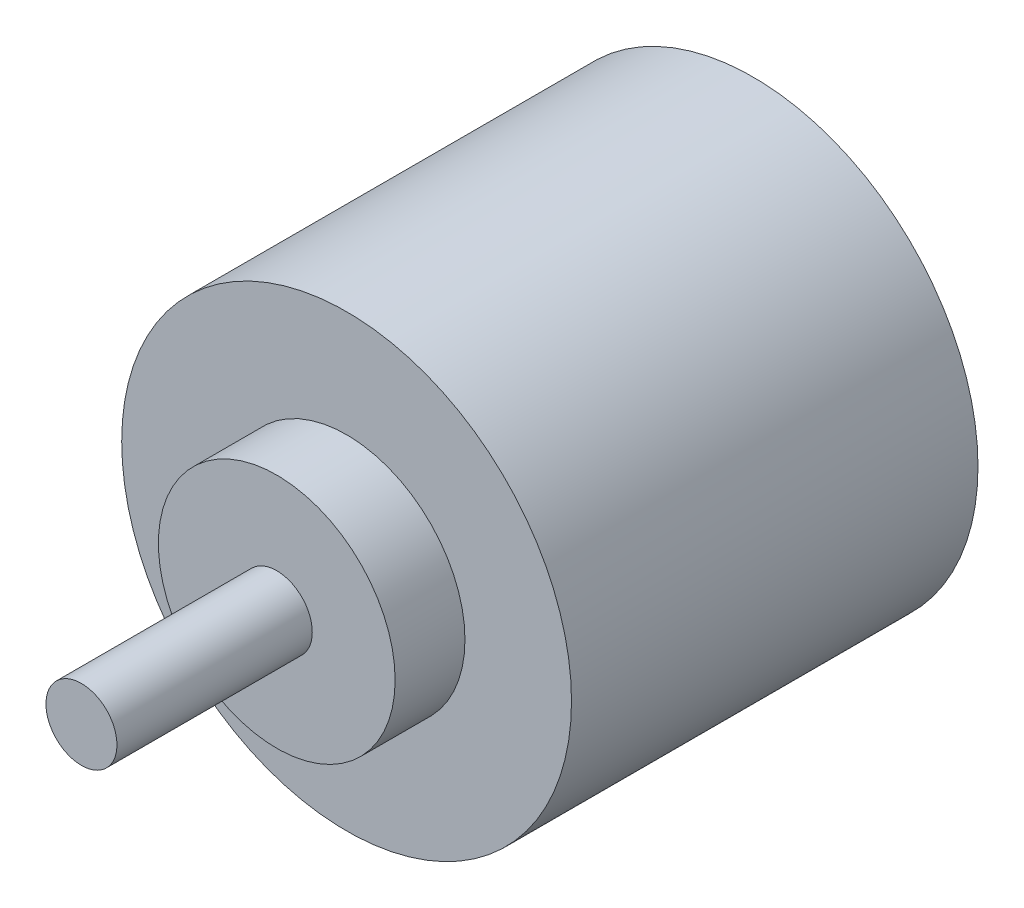
ISO-10303-21;
HEADER;
FILE_DESCRIPTION(('STEP AP214'),'2;1');
FILE_NAME('part.step','',(''),(''),'','','');
FILE_SCHEMA(('AUTOMOTIVE_DESIGN { 1 0 10303 214 1 1 1 1 }'));
ENDSEC;
DATA;
#1=APPLICATION_CONTEXT('core data for automotive mechanical design processes');
#2=APPLICATION_PROTOCOL_DEFINITION('international standard','automotive_design',2000,#1);
#3=PRODUCT_CONTEXT('',#1,'mechanical');
#4=PRODUCT('Part','Part','',(#3));
#5=PRODUCT_RELATED_PRODUCT_CATEGORY('part','',(#4));
#6=PRODUCT_DEFINITION_FORMATION('','',#4);
#7=PRODUCT_DEFINITION_CONTEXT('part definition',#1,'design');
#8=PRODUCT_DEFINITION('design','',#6,#7);
#9=PRODUCT_DEFINITION_SHAPE('','',#8);
#10=(LENGTH_UNIT() NAMED_UNIT(*) SI_UNIT(.MILLI.,.METRE.));
#11=(NAMED_UNIT(*) PLANE_ANGLE_UNIT() SI_UNIT($,.RADIAN.));
#12=(NAMED_UNIT(*) SI_UNIT($,.STERADIAN.) SOLID_ANGLE_UNIT());
#13=UNCERTAINTY_MEASURE_WITH_UNIT(LENGTH_MEASURE(1.E-05),#10,'distance_accuracy_value','');
#14=(GEOMETRIC_REPRESENTATION_CONTEXT(3) GLOBAL_UNCERTAINTY_ASSIGNED_CONTEXT((#13)) GLOBAL_UNIT_ASSIGNED_CONTEXT((#10,
#11,#12)) REPRESENTATION_CONTEXT('',''));
#15=CARTESIAN_POINT('',(0.,0.,0.));
#16=DIRECTION('',(0.,0.,1.));
#17=DIRECTION('',(1.,0.,0.));
#18=AXIS2_PLACEMENT_3D('',#15,#16,#17);
#19=CARTESIAN_POINT('',(0.,0.,34.34));
#20=DIRECTION('',(0.,0.,-1.));
#21=DIRECTION('',(-1.,0.,0.));
#22=AXIS2_PLACEMENT_3D('',#19,#20,#21);
#23=CYLINDRICAL_SURFACE('',#22,19.);
#24=CARTESIAN_POINT('',(0.,0.,34.34));
#25=DIRECTION('',(0.,0.,1.));
#26=DIRECTION('',(1.,0.,0.));
#27=AXIS2_PLACEMENT_3D('',#24,#25,#26);
#28=CIRCLE('',#27,19.);
#29=CARTESIAN_POINT('',(19.,0.,34.34));
#30=VERTEX_POINT('',#29);
#31=EDGE_CURVE('E45',#30,#30,#28,.T.);
#32=ORIENTED_EDGE('',*,*,#31,.F.);
#33=EDGE_LOOP('',(#32));
#34=FACE_BOUND('',#33,.T.);
#35=CARTESIAN_POINT('',(0.,0.,0.));
#36=DIRECTION('',(0.,0.,1.));
#37=DIRECTION('',(1.,0.,0.));
#38=AXIS2_PLACEMENT_3D('',#35,#36,#37);
#39=CIRCLE('',#38,19.);
#40=CARTESIAN_POINT('',(19.,0.,0.));
#41=VERTEX_POINT('',#40);
#42=EDGE_CURVE('E36',#41,#41,#39,.T.);
#43=ORIENTED_EDGE('',*,*,#42,.T.);
#44=EDGE_LOOP('',(#43));
#45=FACE_BOUND('',#44,.T.);
#46=ADVANCED_FACE('F33',(#34,#45),#23,.T.);
#47=CARTESIAN_POINT('',(0.,0.,34.34));
#48=DIRECTION('',(0.,0.,1.));
#49=DIRECTION('',(1.,0.,0.));
#50=AXIS2_PLACEMENT_3D('',#47,#48,#49);
#51=PLANE('',#50);
#52=CARTESIAN_POINT('',(0.,0.,34.34));
#53=DIRECTION('',(0.,0.,1.));
#54=DIRECTION('',(1.,0.,0.));
#55=AXIS2_PLACEMENT_3D('',#52,#53,#54);
#56=CIRCLE('',#55,10.);
#57=CARTESIAN_POINT('',(10.,0.,34.34));
#58=VERTEX_POINT('',#57);
#59=EDGE_CURVE('E40',#58,#58,#56,.T.);
#60=ORIENTED_EDGE('',*,*,#59,.F.);
#61=EDGE_LOOP('',(#60));
#62=FACE_BOUND('',#61,.T.);
#63=ORIENTED_EDGE('',*,*,#31,.T.);
#64=EDGE_LOOP('',(#63));
#65=FACE_BOUND('',#64,.T.);
#66=ADVANCED_FACE('F62',(#62,#65),#51,.T.);
#67=CARTESIAN_POINT('',(0.,0.,0.));
#68=DIRECTION('',(0.,0.,1.));
#69=DIRECTION('',(1.,0.,0.));
#70=AXIS2_PLACEMENT_3D('',#67,#68,#69);
#71=PLANE('',#70);
#72=ORIENTED_EDGE('',*,*,#42,.F.);
#73=EDGE_LOOP('',(#72));
#74=FACE_BOUND('',#73,.T.);
#75=ADVANCED_FACE('F59',(#74),#71,.F.);
#76=CARTESIAN_POINT('',(0.,0.,40.24));
#77=DIRECTION('',(0.,0.,-1.));
#78=DIRECTION('',(-1.,0.,0.));
#79=AXIS2_PLACEMENT_3D('',#76,#77,#78);
#80=CYLINDRICAL_SURFACE('',#79,10.);
#81=CARTESIAN_POINT('',(0.,0.,40.24));
#82=DIRECTION('',(0.,0.,1.));
#83=DIRECTION('',(1.,0.,0.));
#84=AXIS2_PLACEMENT_3D('',#81,#82,#83);
#85=CIRCLE('',#84,10.);
#86=CARTESIAN_POINT('',(10.,0.,40.24));
#87=VERTEX_POINT('',#86);
#88=EDGE_CURVE('E50',#87,#87,#85,.T.);
#89=ORIENTED_EDGE('',*,*,#88,.F.);
#90=EDGE_LOOP('',(#89));
#91=FACE_BOUND('',#90,.T.);
#92=ORIENTED_EDGE('',*,*,#59,.T.);
#93=EDGE_LOOP('',(#92));
#94=FACE_BOUND('',#93,.T.);
#95=ADVANCED_FACE('F61',(#91,#94),#80,.T.);
#96=CARTESIAN_POINT('',(0.,0.,40.24));
#97=DIRECTION('',(0.,0.,1.));
#98=DIRECTION('',(1.,0.,0.));
#99=AXIS2_PLACEMENT_3D('',#96,#97,#98);
#100=PLANE('',#99);
#101=CARTESIAN_POINT('',(0.,0.,40.24));
#102=DIRECTION('',(0.,0.,1.));
#103=DIRECTION('',(1.,0.,0.));
#104=AXIS2_PLACEMENT_3D('',#101,#102,#103);
#105=CIRCLE('',#104,3.);
#106=CARTESIAN_POINT('',(3.,0.,40.24));
#107=VERTEX_POINT('',#106);
#108=EDGE_CURVE('E10',#107,#107,#105,.T.);
#109=ORIENTED_EDGE('',*,*,#108,.F.);
#110=EDGE_LOOP('',(#109));
#111=FACE_BOUND('',#110,.T.);
#112=ORIENTED_EDGE('',*,*,#88,.T.);
#113=EDGE_LOOP('',(#112));
#114=FACE_BOUND('',#113,.T.);
#115=ADVANCED_FACE('F67',(#111,#114),#100,.T.);
#116=CARTESIAN_POINT('',(0.,0.,56.74));
#117=DIRECTION('',(0.,0.,-1.));
#118=DIRECTION('',(-1.,0.,0.));
#119=AXIS2_PLACEMENT_3D('',#116,#117,#118);
#120=CYLINDRICAL_SURFACE('',#119,3.);
#121=CARTESIAN_POINT('',(0.,0.,56.74));
#122=DIRECTION('',(0.,0.,1.));
#123=DIRECTION('',(1.,0.,0.));
#124=AXIS2_PLACEMENT_3D('',#121,#122,#123);
#125=CIRCLE('',#124,3.);
#126=CARTESIAN_POINT('',(3.,0.,56.74));
#127=VERTEX_POINT('',#126);
#128=EDGE_CURVE('E49',#127,#127,#125,.T.);
#129=ORIENTED_EDGE('',*,*,#128,.F.);
#130=EDGE_LOOP('',(#129));
#131=FACE_BOUND('',#130,.T.);
#132=ORIENTED_EDGE('',*,*,#108,.T.);
#133=EDGE_LOOP('',(#132));
#134=FACE_BOUND('',#133,.T.);
#135=ADVANCED_FACE('F97',(#131,#134),#120,.T.);
#136=CARTESIAN_POINT('',(0.,0.,56.74));
#137=DIRECTION('',(0.,0.,1.));
#138=DIRECTION('',(1.,0.,0.));
#139=AXIS2_PLACEMENT_3D('',#136,#137,#138);
#140=PLANE('',#139);
#141=ORIENTED_EDGE('',*,*,#128,.T.);
#142=EDGE_LOOP('',(#141));
#143=FACE_BOUND('',#142,.T.);
#144=ADVANCED_FACE('F107',(#143),#140,.T.);
#145=CLOSED_SHELL('',(#46,#66,#75,#95,#115,#135,#144));
#146=MANIFOLD_SOLID_BREP('B2',#145);
#147=ADVANCED_BREP_SHAPE_REPRESENTATION('',(#18,#146),#14);
#148=SHAPE_DEFINITION_REPRESENTATION(#9,#147);
ENDSEC;
END-ISO-10303-21;
